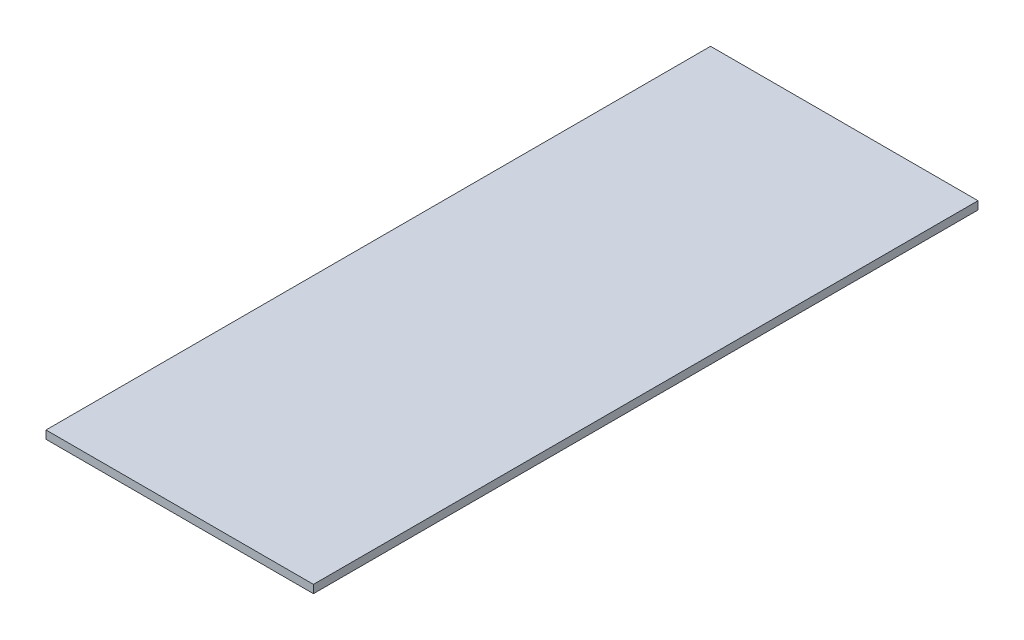
ISO-10303-21;
HEADER;
FILE_DESCRIPTION(('STEP AP214'),'2;1');
FILE_NAME('part.step','',(''),(''),'','','');
FILE_SCHEMA(('AUTOMOTIVE_DESIGN { 1 0 10303 214 1 1 1 1 }'));
ENDSEC;
DATA;
#1=APPLICATION_CONTEXT('core data for automotive mechanical design processes');
#2=APPLICATION_PROTOCOL_DEFINITION('international standard','automotive_design',2000,#1);
#3=PRODUCT_CONTEXT('',#1,'mechanical');
#4=PRODUCT('Part','Part','',(#3));
#5=PRODUCT_RELATED_PRODUCT_CATEGORY('part','',(#4));
#6=PRODUCT_DEFINITION_FORMATION('','',#4);
#7=PRODUCT_DEFINITION_CONTEXT('part definition',#1,'design');
#8=PRODUCT_DEFINITION('design','',#6,#7);
#9=PRODUCT_DEFINITION_SHAPE('','',#8);
#10=(LENGTH_UNIT() NAMED_UNIT(*) SI_UNIT(.MILLI.,.METRE.));
#11=(NAMED_UNIT(*) PLANE_ANGLE_UNIT() SI_UNIT($,.RADIAN.));
#12=(NAMED_UNIT(*) SI_UNIT($,.STERADIAN.) SOLID_ANGLE_UNIT());
#13=UNCERTAINTY_MEASURE_WITH_UNIT(LENGTH_MEASURE(1.E-05),#10,'distance_accuracy_value','');
#14=(GEOMETRIC_REPRESENTATION_CONTEXT(3) GLOBAL_UNCERTAINTY_ASSIGNED_CONTEXT((#13)) GLOBAL_UNIT_ASSIGNED_CONTEXT((#10,
#11,#12)) REPRESENTATION_CONTEXT('',''));
#15=CARTESIAN_POINT('',(0.,0.,0.));
#16=DIRECTION('',(0.,0.,1.));
#17=DIRECTION('',(1.,0.,0.));
#18=AXIS2_PLACEMENT_3D('',#15,#16,#17);
#19=CARTESIAN_POINT('',(-33.,2.,82.));
#20=DIRECTION('',(0.,0.,-1.));
#21=DIRECTION('',(-1.,0.,0.));
#22=AXIS2_PLACEMENT_3D('',#19,#20,#21);
#23=PLANE('',#22);
#24=DIRECTION('',(1.,0.,0.));
#25=VECTOR('',#24,1.);
#26=CARTESIAN_POINT('',(-33.,0.,82.));
#27=LINE('',#26,#25);
#28=CARTESIAN_POINT('',(-33.,0.,82.));
#29=VERTEX_POINT('',#28);
#30=CARTESIAN_POINT('',(33.,0.,82.));
#31=VERTEX_POINT('',#30);
#32=EDGE_CURVE('E96',#29,#31,#27,.T.);
#33=ORIENTED_EDGE('',*,*,#32,.T.);
#34=DIRECTION('',(0.,-1.,0.));
#35=VECTOR('',#34,1.);
#36=CARTESIAN_POINT('',(33.,2.,82.));
#37=LINE('',#36,#35);
#38=CARTESIAN_POINT('',(33.,2.,82.));
#39=VERTEX_POINT('',#38);
#40=EDGE_CURVE('E11',#39,#31,#37,.T.);
#41=ORIENTED_EDGE('',*,*,#40,.F.);
#42=DIRECTION('',(1.,0.,0.));
#43=VECTOR('',#42,1.);
#44=CARTESIAN_POINT('',(-33.,2.,82.));
#45=LINE('',#44,#43);
#46=CARTESIAN_POINT('',(-33.,2.,82.));
#47=VERTEX_POINT('',#46);
#48=EDGE_CURVE('E84',#47,#39,#45,.T.);
#49=ORIENTED_EDGE('',*,*,#48,.F.);
#50=DIRECTION('',(0.,-1.,0.));
#51=VECTOR('',#50,1.);
#52=CARTESIAN_POINT('',(-33.,2.,82.));
#53=LINE('',#52,#51);
#54=EDGE_CURVE('E92',#47,#29,#53,.T.);
#55=ORIENTED_EDGE('',*,*,#54,.T.);
#56=EDGE_LOOP('',(#33,#41,#49,#55));
#57=FACE_BOUND('',#56,.T.);
#58=ADVANCED_FACE('F33',(#57),#23,.F.);
#59=CARTESIAN_POINT('',(33.,2.,82.));
#60=DIRECTION('',(-1.,0.,0.));
#61=DIRECTION('',(0.,0.,1.));
#62=AXIS2_PLACEMENT_3D('',#59,#60,#61);
#63=PLANE('',#62);
#64=DIRECTION('',(0.,0.,-1.));
#65=VECTOR('',#64,1.);
#66=CARTESIAN_POINT('',(33.,0.,82.));
#67=LINE('',#66,#65);
#68=CARTESIAN_POINT('',(33.,0.,-82.));
#69=VERTEX_POINT('',#68);
#70=EDGE_CURVE('E88',#31,#69,#67,.T.);
#71=ORIENTED_EDGE('',*,*,#70,.T.);
#72=DIRECTION('',(0.,-1.,0.));
#73=VECTOR('',#72,1.);
#74=CARTESIAN_POINT('',(33.,2.,-82.));
#75=LINE('',#74,#73);
#76=CARTESIAN_POINT('',(33.,2.,-82.));
#77=VERTEX_POINT('',#76);
#78=EDGE_CURVE('E41',#77,#69,#75,.T.);
#79=ORIENTED_EDGE('',*,*,#78,.F.);
#80=DIRECTION('',(0.,0.,-1.));
#81=VECTOR('',#80,1.);
#82=CARTESIAN_POINT('',(33.,2.,82.));
#83=LINE('',#82,#81);
#84=EDGE_CURVE('E79',#39,#77,#83,.T.);
#85=ORIENTED_EDGE('',*,*,#84,.F.);
#86=ORIENTED_EDGE('',*,*,#40,.T.);
#87=EDGE_LOOP('',(#71,#79,#85,#86));
#88=FACE_BOUND('',#87,.T.);
#89=ADVANCED_FACE('F87',(#88),#63,.F.);
#90=CARTESIAN_POINT('',(-33.,2.,-82.));
#91=DIRECTION('',(0.,0.,1.));
#92=DIRECTION('',(1.,0.,0.));
#93=AXIS2_PLACEMENT_3D('',#90,#91,#92);
#94=PLANE('',#93);
#95=DIRECTION('',(-1.,0.,0.));
#96=VECTOR('',#95,1.);
#97=CARTESIAN_POINT('',(-33.,0.,-82.));
#98=LINE('',#97,#96);
#99=CARTESIAN_POINT('',(-33.,0.,-82.));
#100=VERTEX_POINT('',#99);
#101=EDGE_CURVE('E66',#69,#100,#98,.T.);
#102=ORIENTED_EDGE('',*,*,#101,.T.);
#103=DIRECTION('',(0.,-1.,0.));
#104=VECTOR('',#103,1.);
#105=CARTESIAN_POINT('',(-33.,2.,-82.));
#106=LINE('',#105,#104);
#107=CARTESIAN_POINT('',(-33.,2.,-82.));
#108=VERTEX_POINT('',#107);
#109=EDGE_CURVE('E89',#108,#100,#106,.T.);
#110=ORIENTED_EDGE('',*,*,#109,.F.);
#111=DIRECTION('',(-1.,0.,0.));
#112=VECTOR('',#111,1.);
#113=CARTESIAN_POINT('',(-33.,2.,-82.));
#114=LINE('',#113,#112);
#115=EDGE_CURVE('E82',#77,#108,#114,.T.);
#116=ORIENTED_EDGE('',*,*,#115,.F.);
#117=ORIENTED_EDGE('',*,*,#78,.T.);
#118=EDGE_LOOP('',(#102,#110,#116,#117));
#119=FACE_BOUND('',#118,.T.);
#120=ADVANCED_FACE('F90',(#119),#94,.F.);
#121=CARTESIAN_POINT('',(-33.,2.,82.));
#122=DIRECTION('',(1.,0.,0.));
#123=DIRECTION('',(0.,0.,-1.));
#124=AXIS2_PLACEMENT_3D('',#121,#122,#123);
#125=PLANE('',#124);
#126=DIRECTION('',(0.,0.,1.));
#127=VECTOR('',#126,1.);
#128=CARTESIAN_POINT('',(-33.,0.,82.));
#129=LINE('',#128,#127);
#130=EDGE_CURVE('E72',#100,#29,#129,.T.);
#131=ORIENTED_EDGE('',*,*,#130,.T.);
#132=ORIENTED_EDGE('',*,*,#54,.F.);
#133=DIRECTION('',(0.,0.,1.));
#134=VECTOR('',#133,1.);
#135=CARTESIAN_POINT('',(-33.,2.,82.));
#136=LINE('',#135,#134);
#137=EDGE_CURVE('E49',#108,#47,#136,.T.);
#138=ORIENTED_EDGE('',*,*,#137,.F.);
#139=ORIENTED_EDGE('',*,*,#109,.T.);
#140=EDGE_LOOP('',(#131,#132,#138,#139));
#141=FACE_BOUND('',#140,.T.);
#142=ADVANCED_FACE('F103',(#141),#125,.F.);
#143=CARTESIAN_POINT('',(0.,2.,0.));
#144=DIRECTION('',(0.,1.,0.));
#145=DIRECTION('',(0.,0.,1.));
#146=AXIS2_PLACEMENT_3D('',#143,#144,#145);
#147=PLANE('',#146);
#148=ORIENTED_EDGE('',*,*,#48,.T.);
#149=ORIENTED_EDGE('',*,*,#84,.T.);
#150=ORIENTED_EDGE('',*,*,#115,.T.);
#151=ORIENTED_EDGE('',*,*,#137,.T.);
#152=EDGE_LOOP('',(#148,#149,#150,#151));
#153=FACE_BOUND('',#152,.T.);
#154=ADVANCED_FACE('F80',(#153),#147,.T.);
#155=CARTESIAN_POINT('',(0.,0.,0.));
#156=DIRECTION('',(0.,1.,0.));
#157=DIRECTION('',(0.,0.,1.));
#158=AXIS2_PLACEMENT_3D('',#155,#156,#157);
#159=PLANE('',#158);
#160=ORIENTED_EDGE('',*,*,#32,.F.);
#161=ORIENTED_EDGE('',*,*,#130,.F.);
#162=ORIENTED_EDGE('',*,*,#101,.F.);
#163=ORIENTED_EDGE('',*,*,#70,.F.);
#164=EDGE_LOOP('',(#160,#161,#162,#163));
#165=FACE_BOUND('',#164,.T.);
#166=ADVANCED_FACE('F106',(#165),#159,.F.);
#167=CLOSED_SHELL('',(#58,#89,#120,#142,#154,#166));
#168=MANIFOLD_SOLID_BREP('B2',#167);
#169=ADVANCED_BREP_SHAPE_REPRESENTATION('',(#18,#168),#14);
#170=SHAPE_DEFINITION_REPRESENTATION(#9,#169);
ENDSEC;
END-ISO-10303-21;
